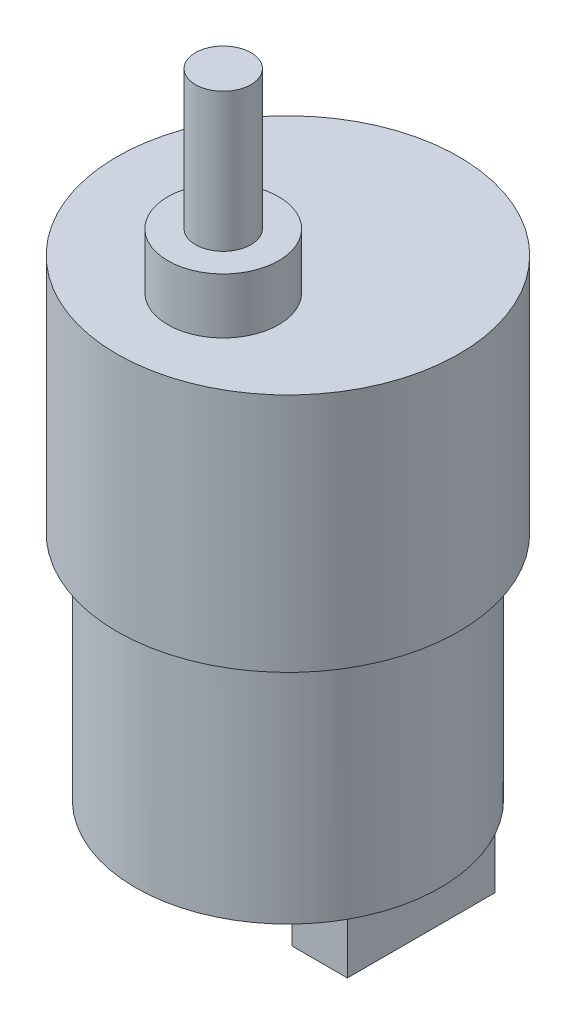
ISO-10303-21;
HEADER;
FILE_DESCRIPTION(('STEP AP214'),'2;1');
FILE_NAME('part.step','',(''),(''),'','','');
FILE_SCHEMA(('AUTOMOTIVE_DESIGN { 1 0 10303 214 1 1 1 1 }'));
ENDSEC;
DATA;
#1=APPLICATION_CONTEXT('core data for automotive mechanical design processes');
#2=APPLICATION_PROTOCOL_DEFINITION('international standard','automotive_design',2000,#1);
#3=PRODUCT_CONTEXT('',#1,'mechanical');
#4=PRODUCT('Part','Part','',(#3));
#5=PRODUCT_RELATED_PRODUCT_CATEGORY('part','',(#4));
#6=PRODUCT_DEFINITION_FORMATION('','',#4);
#7=PRODUCT_DEFINITION_CONTEXT('part definition',#1,'design');
#8=PRODUCT_DEFINITION('design','',#6,#7);
#9=PRODUCT_DEFINITION_SHAPE('','',#8);
#10=(LENGTH_UNIT() NAMED_UNIT(*) SI_UNIT(.MILLI.,.METRE.));
#11=(NAMED_UNIT(*) PLANE_ANGLE_UNIT() SI_UNIT($,.RADIAN.));
#12=(NAMED_UNIT(*) SI_UNIT($,.STERADIAN.) SOLID_ANGLE_UNIT());
#13=UNCERTAINTY_MEASURE_WITH_UNIT(LENGTH_MEASURE(1.E-05),#10,'distance_accuracy_value','');
#14=(GEOMETRIC_REPRESENTATION_CONTEXT(3) GLOBAL_UNCERTAINTY_ASSIGNED_CONTEXT((#13)) GLOBAL_UNIT_ASSIGNED_CONTEXT((#10,
#11,#12)) REPRESENTATION_CONTEXT('',''));
#15=CARTESIAN_POINT('',(0.,0.,0.));
#16=DIRECTION('',(0.,0.,1.));
#17=DIRECTION('',(1.,0.,0.));
#18=AXIS2_PLACEMENT_3D('',#15,#16,#17);
#19=CARTESIAN_POINT('',(0.,-51.,0.));
#20=DIRECTION('',(0.,1.,0.));
#21=DIRECTION('',(0.,0.,1.));
#22=AXIS2_PLACEMENT_3D('',#19,#20,#21);
#23=PLANE('',#22);
#24=CARTESIAN_POINT('',(0.,-51.,0.));
#25=DIRECTION('',(0.,1.,0.));
#26=DIRECTION('',(0.,0.,1.));
#27=AXIS2_PLACEMENT_3D('',#24,#25,#26);
#28=CIRCLE('',#27,4.5);
#29=CARTESIAN_POINT('',(0.,-51.,4.5));
#30=VERTEX_POINT('',#29);
#31=EDGE_CURVE('E199',#30,#30,#28,.T.);
#32=ORIENTED_EDGE('',*,*,#31,.T.);
#33=EDGE_LOOP('',(#32));
#34=FACE_BOUND('',#33,.T.);
#35=DIRECTION('',(1.,0.,0.));
#36=VECTOR('',#35,1.);
#37=CARTESIAN_POINT('',(0.,-51.,-8.));
#38=LINE('',#37,#36);
#39=CARTESIAN_POINT('',(8.43086968966181,-51.,-8.));
#40=VERTEX_POINT('',#39);
#41=CARTESIAN_POINT('',(14.4308696896618,-51.,-8.));
#42=VERTEX_POINT('',#41);
#43=EDGE_CURVE('E69',#40,#42,#38,.T.);
#44=ORIENTED_EDGE('',*,*,#43,.F.);
#45=DIRECTION('',(0.,0.,-1.));
#46=VECTOR('',#45,1.);
#47=CARTESIAN_POINT('',(8.43086968966181,-51.,0.));
#48=LINE('',#47,#46);
#49=CARTESIAN_POINT('',(8.43086968966181,-51.,8.));
#50=VERTEX_POINT('',#49);
#51=EDGE_CURVE('E95',#50,#40,#48,.T.);
#52=ORIENTED_EDGE('',*,*,#51,.F.);
#53=DIRECTION('',(1.,0.,0.));
#54=VECTOR('',#53,1.);
#55=CARTESIAN_POINT('',(0.,-51.,8.));
#56=LINE('',#55,#54);
#57=CARTESIAN_POINT('',(14.4308696896618,-51.,8.));
#58=VERTEX_POINT('',#57);
#59=EDGE_CURVE('E128',#50,#58,#56,.T.);
#60=ORIENTED_EDGE('',*,*,#59,.T.);
#61=CARTESIAN_POINT('',(0.,-51.,0.));
#62=DIRECTION('',(0.,1.,0.));
#63=DIRECTION('',(0.,0.,1.));
#64=AXIS2_PLACEMENT_3D('',#61,#62,#63);
#65=CIRCLE('',#64,16.5);
#66=EDGE_CURVE('E138',#42,#58,#65,.T.);
#67=ORIENTED_EDGE('',*,*,#66,.F.);
#68=EDGE_LOOP('',(#44,#52,#60,#67));
#69=FACE_BOUND('',#68,.T.);
#70=ADVANCED_FACE('F52',(#34,#69),#23,.F.);
#71=CARTESIAN_POINT('',(0.,-26.,0.));
#72=DIRECTION('',(0.,1.,0.));
#73=DIRECTION('',(0.,0.,1.));
#74=AXIS2_PLACEMENT_3D('',#71,#72,#73);
#75=CYLINDRICAL_SURFACE('',#74,18.5);
#76=CARTESIAN_POINT('',(0.,-26.,0.));
#77=DIRECTION('',(0.,1.,0.));
#78=DIRECTION('',(0.,0.,1.));
#79=AXIS2_PLACEMENT_3D('',#76,#77,#78);
#80=CIRCLE('',#79,18.5);
#81=CARTESIAN_POINT('',(0.,-26.,18.5));
#82=VERTEX_POINT('',#81);
#83=EDGE_CURVE('E61',#82,#82,#80,.T.);
#84=CARTESIAN_POINT('',(0.,0.,0.));
#85=DIRECTION('',(0.,1.,0.));
#86=DIRECTION('',(0.,0.,1.));
#87=AXIS2_PLACEMENT_3D('',#84,#85,#86);
#88=CIRCLE('',#87,18.5);
#89=CARTESIAN_POINT('',(0.,0.,18.5));
#90=VERTEX_POINT('',#89);
#91=EDGE_CURVE('E56',#90,#90,#88,.T.);
#92=CARTESIAN_POINT('',(0.,-26.,18.5));
#93=CARTESIAN_POINT('',(0.,-25.7291666666667,18.5));
#94=CARTESIAN_POINT('',(0.,-25.4583333333333,18.5));
#95=CARTESIAN_POINT('',(0.,-24.9166666666667,18.5));
#96=CARTESIAN_POINT('',(0.,-24.6458333333333,18.5));
#97=CARTESIAN_POINT('',(0.,-24.1041666666667,18.5));
#98=CARTESIAN_POINT('',(0.,-23.8333333333333,18.5));
#99=CARTESIAN_POINT('',(0.,-23.2916666666667,18.5));
#100=CARTESIAN_POINT('',(0.,-23.0208333333333,18.5));
#101=CARTESIAN_POINT('',(0.,-22.4791666666667,18.5));
#102=CARTESIAN_POINT('',(0.,-22.2083333333333,18.5));
#103=CARTESIAN_POINT('',(0.,-21.6666666666667,18.5));
#104=CARTESIAN_POINT('',(0.,-21.3958333333333,18.5));
#105=CARTESIAN_POINT('',(0.,-20.8541666666667,18.5));
#106=CARTESIAN_POINT('',(0.,-20.5833333333333,18.5));
#107=CARTESIAN_POINT('',(0.,-20.0416666666667,18.5));
#108=CARTESIAN_POINT('',(0.,-19.7708333333333,18.5));
#109=CARTESIAN_POINT('',(0.,-19.2291666666667,18.5));
#110=CARTESIAN_POINT('',(0.,-18.9583333333333,18.5));
#111=CARTESIAN_POINT('',(0.,-18.4166666666667,18.5));
#112=CARTESIAN_POINT('',(0.,-18.1458333333333,18.5));
#113=CARTESIAN_POINT('',(0.,-17.6041666666667,18.5));
#114=CARTESIAN_POINT('',(0.,-17.3333333333333,18.5));
#115=CARTESIAN_POINT('',(0.,-16.7916666666667,18.5));
#116=CARTESIAN_POINT('',(0.,-16.5208333333333,18.5));
#117=CARTESIAN_POINT('',(0.,-15.9791666666667,18.5));
#118=CARTESIAN_POINT('',(0.,-15.7083333333333,18.5));
#119=CARTESIAN_POINT('',(0.,-15.1666666666667,18.5));
#120=CARTESIAN_POINT('',(0.,-14.8958333333333,18.5));
#121=CARTESIAN_POINT('',(0.,-14.3541666666667,18.5));
#122=CARTESIAN_POINT('',(0.,-14.0833333333333,18.5));
#123=CARTESIAN_POINT('',(0.,-13.5416666666667,18.5));
#124=CARTESIAN_POINT('',(0.,-13.2708333333333,18.5));
#125=CARTESIAN_POINT('',(0.,-12.7291666666667,18.5));
#126=CARTESIAN_POINT('',(0.,-12.4583333333333,18.5));
#127=CARTESIAN_POINT('',(0.,-11.9166666666667,18.5));
#128=CARTESIAN_POINT('',(0.,-11.6458333333333,18.5));
#129=CARTESIAN_POINT('',(0.,-11.1041666666667,18.5));
#130=CARTESIAN_POINT('',(0.,-10.8333333333333,18.5));
#131=CARTESIAN_POINT('',(0.,-10.2916666666667,18.5));
#132=CARTESIAN_POINT('',(0.,-10.0208333333333,18.5));
#133=CARTESIAN_POINT('',(0.,-9.47916666666667,18.5));
#134=CARTESIAN_POINT('',(0.,-9.20833333333333,18.5));
#135=CARTESIAN_POINT('',(0.,-8.66666666666667,18.5));
#136=CARTESIAN_POINT('',(0.,-8.39583333333333,18.5));
#137=CARTESIAN_POINT('',(0.,-7.85416666666667,18.5));
#138=CARTESIAN_POINT('',(0.,-7.58333333333333,18.5));
#139=CARTESIAN_POINT('',(0.,-7.04166666666667,18.5));
#140=CARTESIAN_POINT('',(0.,-6.77083333333333,18.5));
#141=CARTESIAN_POINT('',(0.,-6.22916666666667,18.5));
#142=CARTESIAN_POINT('',(0.,-5.95833333333333,18.5));
#143=CARTESIAN_POINT('',(0.,-5.41666666666667,18.5));
#144=CARTESIAN_POINT('',(0.,-5.14583333333333,18.5));
#145=CARTESIAN_POINT('',(0.,-4.60416666666667,18.5));
#146=CARTESIAN_POINT('',(0.,-4.33333333333333,18.5));
#147=CARTESIAN_POINT('',(0.,-3.79166666666667,18.5));
#148=CARTESIAN_POINT('',(0.,-3.52083333333333,18.5));
#149=CARTESIAN_POINT('',(0.,-2.97916666666667,18.5));
#150=CARTESIAN_POINT('',(0.,-2.70833333333333,18.5));
#151=CARTESIAN_POINT('',(0.,-2.16666666666667,18.5));
#152=CARTESIAN_POINT('',(0.,-1.89583333333333,18.5));
#153=CARTESIAN_POINT('',(0.,-1.35416666666667,18.5));
#154=CARTESIAN_POINT('',(0.,-1.08333333333333,18.5));
#155=CARTESIAN_POINT('',(0.,-0.541666666666667,18.5));
#156=CARTESIAN_POINT('',(0.,-0.270833333333334,18.5));
#157=CARTESIAN_POINT('',(0.,0.,18.5));
#158=B_SPLINE_CURVE_WITH_KNOTS('',3,(#92,#93,#94,#95,#96,#97,#98,#99,#100,#101,#102,#103,#104,
#105,#106,#107,#108,#109,#110,#111,#112,#113,#114,#115,#116,#117,#118,#119,#120,#121,#122,#123,
#124,#125,#126,#127,#128,#129,#130,#131,#132,#133,#134,#135,#136,#137,#138,#139,#140,#141,#142,
#143,#144,#145,#146,#147,#148,#149,#150,#151,#152,#153,#154,#155,#156,#157),.UNSPECIFIED.,.F.,
.F.,(4,2,2,2,2,2,2,2,2,2,2,2,2,2,2,2,2,2,2,2,2,2,2,2,2,2,2,2,2,2,2,2,4),(0.,0.812499999999997,
1.625,2.4375,3.25,4.0625,4.875,5.6875,6.5,7.3125,8.125,8.9375,9.75,10.5625,11.375,12.1875,13.,
13.8125,14.625,15.4375,16.25,17.0625,17.875,18.6875,19.5,20.3125,21.125,21.9375,22.75,23.5625,
24.375,25.1875,26.),.UNSPECIFIED.);
#159=EDGE_CURVE('BSEAM54',#82,#90,#158,.T.);
#160=ORIENTED_EDGE('',*,*,#83,.T.);
#161=ORIENTED_EDGE('',*,*,#91,.F.);
#162=ORIENTED_EDGE('',*,*,#159,.T.);
#163=ORIENTED_EDGE('',*,*,#159,.F.);
#164=EDGE_LOOP('',(#160,#162,#161,#163));
#165=FACE_BOUND('',#164,.T.);
#166=ADVANCED_FACE('F54',(#165),#75,.T.);
#167=CARTESIAN_POINT('',(0.,-26.,0.));
#168=DIRECTION('',(0.,1.,0.));
#169=DIRECTION('',(0.,0.,1.));
#170=AXIS2_PLACEMENT_3D('',#167,#168,#169);
#171=PLANE('',#170);
#172=CARTESIAN_POINT('',(0.,-26.,0.));
#173=DIRECTION('',(0.,1.,0.));
#174=DIRECTION('',(0.,0.,1.));
#175=AXIS2_PLACEMENT_3D('',#172,#173,#174);
#176=CIRCLE('',#175,16.5);
#177=CARTESIAN_POINT('',(0.,-26.,16.5));
#178=VERTEX_POINT('',#177);
#179=EDGE_CURVE('E134',#178,#178,#176,.T.);
#180=ORIENTED_EDGE('',*,*,#179,.T.);
#181=EDGE_LOOP('',(#180));
#182=FACE_BOUND('',#181,.T.);
#183=ORIENTED_EDGE('',*,*,#83,.F.);
#184=EDGE_LOOP('',(#183));
#185=FACE_BOUND('',#184,.T.);
#186=ADVANCED_FACE('F149',(#182,#185),#171,.F.);
#187=CARTESIAN_POINT('',(0.,0.,0.));
#188=DIRECTION('',(0.,1.,0.));
#189=DIRECTION('',(0.,0.,1.));
#190=AXIS2_PLACEMENT_3D('',#187,#188,#189);
#191=PLANE('',#190);
#192=CARTESIAN_POINT('',(0.,0.,7.));
#193=DIRECTION('',(0.,1.,0.));
#194=DIRECTION('',(0.,0.,1.));
#195=AXIS2_PLACEMENT_3D('',#192,#193,#194);
#196=CIRCLE('',#195,6.);
#197=CARTESIAN_POINT('',(0.,0.,13.));
#198=VERTEX_POINT('',#197);
#199=EDGE_CURVE('E193',#198,#198,#196,.T.);
#200=ORIENTED_EDGE('',*,*,#199,.F.);
#201=EDGE_LOOP('',(#200));
#202=FACE_BOUND('',#201,.T.);
#203=ORIENTED_EDGE('',*,*,#91,.T.);
#204=EDGE_LOOP('',(#203));
#205=FACE_BOUND('',#204,.T.);
#206=ADVANCED_FACE('F146',(#202,#205),#191,.T.);
#207=CARTESIAN_POINT('',(0.,-51.,0.));
#208=DIRECTION('',(0.,1.,0.));
#209=DIRECTION('',(0.,0.,1.));
#210=AXIS2_PLACEMENT_3D('',#207,#208,#209);
#211=CYLINDRICAL_SURFACE('',#210,16.5);
#212=ORIENTED_EDGE('',*,*,#179,.F.);
#213=EDGE_LOOP('',(#212));
#214=FACE_BOUND('',#213,.T.);
#215=EDGE_CURVE('E135',#58,#42,#65,.T.);
#216=ORIENTED_EDGE('',*,*,#215,.T.);
#217=ORIENTED_EDGE('',*,*,#66,.T.);
#218=EDGE_LOOP('',(#216,#217));
#219=FACE_BOUND('',#218,.T.);
#220=ADVANCED_FACE('F169',(#214,#219),#211,.T.);
#221=ORIENTED_EDGE('',*,*,#215,.F.);
#222=DIRECTION('',(0.,0.,-1.));
#223=VECTOR('',#222,1.);
#224=CARTESIAN_POINT('',(14.4308696896618,-51.,0.));
#225=LINE('',#224,#223);
#226=EDGE_CURVE('E108',#58,#42,#225,.T.);
#227=ORIENTED_EDGE('',*,*,#226,.T.);
#228=EDGE_LOOP('',(#221,#227));
#229=FACE_BOUND('',#228,.T.);
#230=ADVANCED_FACE('F158',(#229),#23,.F.);
#231=CARTESIAN_POINT('',(0.,-56.5,-8.));
#232=DIRECTION('',(0.,0.,1.));
#233=DIRECTION('',(1.,0.,0.));
#234=AXIS2_PLACEMENT_3D('',#231,#232,#233);
#235=PLANE('',#234);
#236=ORIENTED_EDGE('',*,*,#43,.T.);
#237=DIRECTION('',(0.,1.,0.));
#238=VECTOR('',#237,1.);
#239=CARTESIAN_POINT('',(14.4308696896618,-56.5,-8.));
#240=LINE('',#239,#238);
#241=CARTESIAN_POINT('',(14.4308696896618,-56.5,-8.));
#242=VERTEX_POINT('',#241);
#243=EDGE_CURVE('E113',#242,#42,#240,.T.);
#244=ORIENTED_EDGE('',*,*,#243,.F.);
#245=DIRECTION('',(1.,0.,0.));
#246=VECTOR('',#245,1.);
#247=CARTESIAN_POINT('',(0.,-56.5,-8.));
#248=LINE('',#247,#246);
#249=CARTESIAN_POINT('',(8.43086968966181,-56.5,-8.));
#250=VERTEX_POINT('',#249);
#251=EDGE_CURVE('E99',#250,#242,#248,.T.);
#252=ORIENTED_EDGE('',*,*,#251,.F.);
#253=DIRECTION('',(0.,1.,0.));
#254=VECTOR('',#253,1.);
#255=CARTESIAN_POINT('',(8.43086968966181,-56.5,-8.));
#256=LINE('',#255,#254);
#257=EDGE_CURVE('E121',#250,#40,#256,.T.);
#258=ORIENTED_EDGE('',*,*,#257,.T.);
#259=EDGE_LOOP('',(#236,#244,#252,#258));
#260=FACE_BOUND('',#259,.T.);
#261=ADVANCED_FACE('F168',(#260),#235,.F.);
#262=CARTESIAN_POINT('',(14.4308696896618,-56.5,0.));
#263=DIRECTION('',(1.,0.,0.));
#264=DIRECTION('',(0.,0.,-1.));
#265=AXIS2_PLACEMENT_3D('',#262,#263,#264);
#266=PLANE('',#265);
#267=ORIENTED_EDGE('',*,*,#226,.F.);
#268=DIRECTION('',(0.,1.,0.));
#269=VECTOR('',#268,1.);
#270=CARTESIAN_POINT('',(14.4308696896618,-56.5,8.));
#271=LINE('',#270,#269);
#272=CARTESIAN_POINT('',(14.4308696896618,-56.5,8.));
#273=VERTEX_POINT('',#272);
#274=EDGE_CURVE('E104',#273,#58,#271,.T.);
#275=ORIENTED_EDGE('',*,*,#274,.F.);
#276=DIRECTION('',(0.,0.,-1.));
#277=VECTOR('',#276,1.);
#278=CARTESIAN_POINT('',(14.4308696896618,-56.5,0.));
#279=LINE('',#278,#277);
#280=EDGE_CURVE('E106',#273,#242,#279,.T.);
#281=ORIENTED_EDGE('',*,*,#280,.T.);
#282=ORIENTED_EDGE('',*,*,#243,.T.);
#283=EDGE_LOOP('',(#267,#275,#281,#282));
#284=FACE_BOUND('',#283,.T.);
#285=ADVANCED_FACE('F105',(#284),#266,.T.);
#286=CARTESIAN_POINT('',(0.,-56.5,8.));
#287=DIRECTION('',(0.,0.,1.));
#288=DIRECTION('',(1.,0.,0.));
#289=AXIS2_PLACEMENT_3D('',#286,#287,#288);
#290=PLANE('',#289);
#291=ORIENTED_EDGE('',*,*,#59,.F.);
#292=DIRECTION('',(0.,1.,0.));
#293=VECTOR('',#292,1.);
#294=CARTESIAN_POINT('',(8.43086968966181,-56.5,8.));
#295=LINE('',#294,#293);
#296=CARTESIAN_POINT('',(8.43086968966181,-56.5,8.));
#297=VERTEX_POINT('',#296);
#298=EDGE_CURVE('E114',#297,#50,#295,.T.);
#299=ORIENTED_EDGE('',*,*,#298,.F.);
#300=DIRECTION('',(1.,0.,0.));
#301=VECTOR('',#300,1.);
#302=CARTESIAN_POINT('',(0.,-56.5,8.));
#303=LINE('',#302,#301);
#304=EDGE_CURVE('E117',#297,#273,#303,.T.);
#305=ORIENTED_EDGE('',*,*,#304,.T.);
#306=ORIENTED_EDGE('',*,*,#274,.T.);
#307=EDGE_LOOP('',(#291,#299,#305,#306));
#308=FACE_BOUND('',#307,.T.);
#309=ADVANCED_FACE('F119',(#308),#290,.T.);
#310=CARTESIAN_POINT('',(8.43086968966181,-56.5,0.));
#311=DIRECTION('',(1.,0.,0.));
#312=DIRECTION('',(0.,0.,-1.));
#313=AXIS2_PLACEMENT_3D('',#310,#311,#312);
#314=PLANE('',#313);
#315=ORIENTED_EDGE('',*,*,#51,.T.);
#316=ORIENTED_EDGE('',*,*,#257,.F.);
#317=DIRECTION('',(0.,0.,-1.));
#318=VECTOR('',#317,1.);
#319=CARTESIAN_POINT('',(8.43086968966181,-56.5,0.));
#320=LINE('',#319,#318);
#321=EDGE_CURVE('E78',#297,#250,#320,.T.);
#322=ORIENTED_EDGE('',*,*,#321,.F.);
#323=ORIENTED_EDGE('',*,*,#298,.T.);
#324=EDGE_LOOP('',(#315,#316,#322,#323));
#325=FACE_BOUND('',#324,.T.);
#326=ADVANCED_FACE('F220',(#325),#314,.F.);
#327=CARTESIAN_POINT('',(0.,-56.5,0.));
#328=DIRECTION('',(0.,1.,0.));
#329=DIRECTION('',(0.,0.,1.));
#330=AXIS2_PLACEMENT_3D('',#327,#328,#329);
#331=PLANE('',#330);
#332=ORIENTED_EDGE('',*,*,#251,.T.);
#333=ORIENTED_EDGE('',*,*,#280,.F.);
#334=ORIENTED_EDGE('',*,*,#304,.F.);
#335=ORIENTED_EDGE('',*,*,#321,.T.);
#336=EDGE_LOOP('',(#332,#333,#334,#335));
#337=FACE_BOUND('',#336,.T.);
#338=ADVANCED_FACE('F116',(#337),#331,.F.);
#339=CARTESIAN_POINT('',(0.,-59.5,0.));
#340=DIRECTION('',(0.,1.,0.));
#341=DIRECTION('',(0.,0.,1.));
#342=AXIS2_PLACEMENT_3D('',#339,#340,#341);
#343=CYLINDRICAL_SURFACE('',#342,4.5);
#344=CARTESIAN_POINT('',(0.,-59.5,0.));
#345=DIRECTION('',(0.,1.,0.));
#346=DIRECTION('',(0.,0.,1.));
#347=AXIS2_PLACEMENT_3D('',#344,#345,#346);
#348=CIRCLE('',#347,4.5);
#349=CARTESIAN_POINT('',(0.,-59.5,4.5));
#350=VERTEX_POINT('',#349);
#351=EDGE_CURVE('E126',#350,#350,#348,.T.);
#352=ORIENTED_EDGE('',*,*,#351,.T.);
#353=EDGE_LOOP('',(#352));
#354=FACE_BOUND('',#353,.T.);
#355=ORIENTED_EDGE('',*,*,#31,.F.);
#356=EDGE_LOOP('',(#355));
#357=FACE_BOUND('',#356,.T.);
#358=ADVANCED_FACE('F208',(#354,#357),#343,.T.);
#359=CARTESIAN_POINT('',(0.,-59.5,0.));
#360=DIRECTION('',(0.,1.,0.));
#361=DIRECTION('',(0.,0.,1.));
#362=AXIS2_PLACEMENT_3D('',#359,#360,#361);
#363=PLANE('',#362);
#364=ORIENTED_EDGE('',*,*,#351,.F.);
#365=EDGE_LOOP('',(#364));
#366=FACE_BOUND('',#365,.T.);
#367=ADVANCED_FACE('F210',(#366),#363,.F.);
#368=CARTESIAN_POINT('',(0.,6.,7.));
#369=DIRECTION('',(0.,-1.,0.));
#370=DIRECTION('',(0.,0.,-1.));
#371=AXIS2_PLACEMENT_3D('',#368,#369,#370);
#372=CYLINDRICAL_SURFACE('',#371,6.);
#373=CARTESIAN_POINT('',(0.,6.,7.));
#374=DIRECTION('',(0.,1.,0.));
#375=DIRECTION('',(0.,0.,1.));
#376=AXIS2_PLACEMENT_3D('',#373,#374,#375);
#377=CIRCLE('',#376,6.);
#378=CARTESIAN_POINT('',(0.,6.,13.));
#379=VERTEX_POINT('',#378);
#380=EDGE_CURVE('E195',#379,#379,#377,.T.);
#381=ORIENTED_EDGE('',*,*,#380,.F.);
#382=EDGE_LOOP('',(#381));
#383=FACE_BOUND('',#382,.T.);
#384=ORIENTED_EDGE('',*,*,#199,.T.);
#385=EDGE_LOOP('',(#384));
#386=FACE_BOUND('',#385,.T.);
#387=ADVANCED_FACE('F217',(#383,#386),#372,.T.);
#388=CARTESIAN_POINT('',(0.,6.,0.));
#389=DIRECTION('',(0.,1.,0.));
#390=DIRECTION('',(0.,0.,1.));
#391=AXIS2_PLACEMENT_3D('',#388,#389,#390);
#392=PLANE('',#391);
#393=CARTESIAN_POINT('',(0.,6.,7.));
#394=DIRECTION('',(0.,1.,0.));
#395=DIRECTION('',(0.,0.,1.));
#396=AXIS2_PLACEMENT_3D('',#393,#394,#395);
#397=CIRCLE('',#396,3.);
#398=CARTESIAN_POINT('',(0.,6.,10.));
#399=VERTEX_POINT('',#398);
#400=EDGE_CURVE('E12',#399,#399,#397,.T.);
#401=ORIENTED_EDGE('',*,*,#400,.F.);
#402=EDGE_LOOP('',(#401));
#403=FACE_BOUND('',#402,.T.);
#404=ORIENTED_EDGE('',*,*,#380,.T.);
#405=EDGE_LOOP('',(#404));
#406=FACE_BOUND('',#405,.T.);
#407=ADVANCED_FACE('F267',(#403,#406),#392,.T.);
#408=CARTESIAN_POINT('',(0.,21.,7.));
#409=DIRECTION('',(0.,-1.,0.));
#410=DIRECTION('',(0.,0.,-1.));
#411=AXIS2_PLACEMENT_3D('',#408,#409,#410);
#412=CYLINDRICAL_SURFACE('',#411,3.);
#413=CARTESIAN_POINT('',(0.,21.,7.));
#414=DIRECTION('',(0.,1.,0.));
#415=DIRECTION('',(0.,0.,1.));
#416=AXIS2_PLACEMENT_3D('',#413,#414,#415);
#417=CIRCLE('',#416,3.);
#418=CARTESIAN_POINT('',(0.,21.,10.));
#419=VERTEX_POINT('',#418);
#420=EDGE_CURVE('E196',#419,#419,#417,.T.);
#421=ORIENTED_EDGE('',*,*,#420,.F.);
#422=EDGE_LOOP('',(#421));
#423=FACE_BOUND('',#422,.T.);
#424=ORIENTED_EDGE('',*,*,#400,.T.);
#425=EDGE_LOOP('',(#424));
#426=FACE_BOUND('',#425,.T.);
#427=ADVANCED_FACE('F277',(#423,#426),#412,.T.);
#428=CARTESIAN_POINT('',(0.,21.,7.));
#429=DIRECTION('',(0.,1.,0.));
#430=DIRECTION('',(0.,0.,1.));
#431=AXIS2_PLACEMENT_3D('',#428,#429,#430);
#432=PLANE('',#431);
#433=ORIENTED_EDGE('',*,*,#420,.T.);
#434=EDGE_LOOP('',(#433));
#435=FACE_BOUND('',#434,.T.);
#436=ADVANCED_FACE('F290',(#435),#432,.T.);
#437=CLOSED_SHELL('',(#70,#166,#186,#206,#220,#230,#261,#285,#309,#326,#338,#358,#367,#387,#407,
#427,#436));
#438=MANIFOLD_SOLID_BREP('B2',#437);
#439=ADVANCED_BREP_SHAPE_REPRESENTATION('',(#18,#438),#14);
#440=SHAPE_DEFINITION_REPRESENTATION(#9,#439);
ENDSEC;
END-ISO-10303-21;
